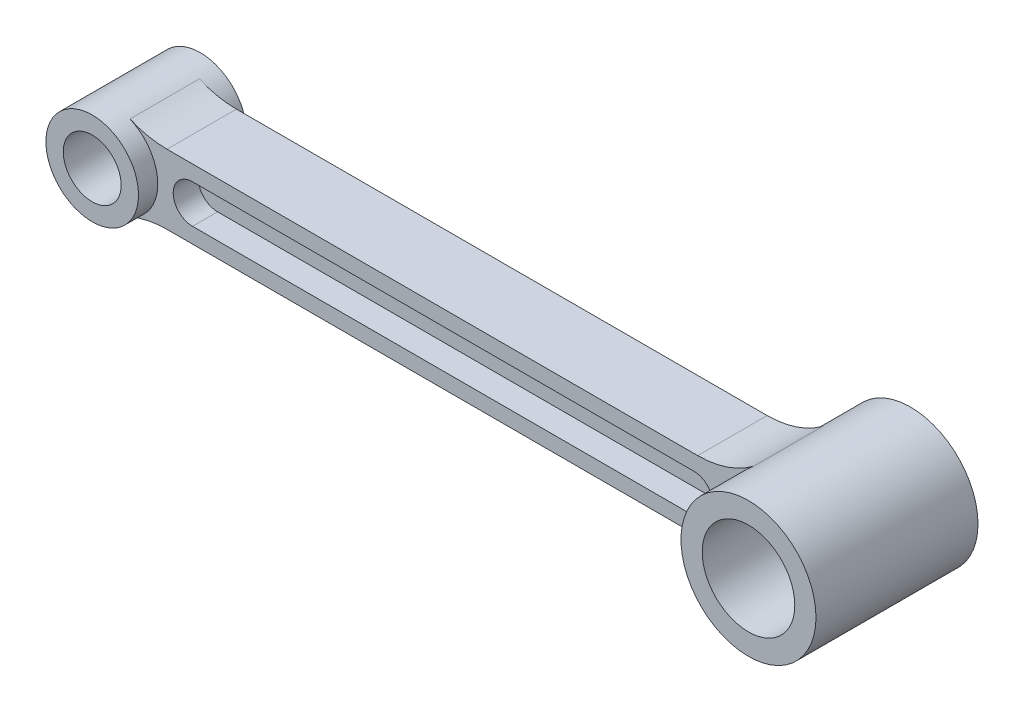
ISO-10303-21;
HEADER;
FILE_DESCRIPTION(('STEP AP214'),'2;1');
FILE_NAME('part.step','',(''),(''),'','','');
FILE_SCHEMA(('AUTOMOTIVE_DESIGN { 1 0 10303 214 1 1 1 1 }'));
ENDSEC;
DATA;
#1=APPLICATION_CONTEXT('core data for automotive mechanical design processes');
#2=APPLICATION_PROTOCOL_DEFINITION('international standard','automotive_design',2000,#1);
#3=PRODUCT_CONTEXT('',#1,'mechanical');
#4=PRODUCT('Part','Part','',(#3));
#5=PRODUCT_RELATED_PRODUCT_CATEGORY('part','',(#4));
#6=PRODUCT_DEFINITION_FORMATION('','',#4);
#7=PRODUCT_DEFINITION_CONTEXT('part definition',#1,'design');
#8=PRODUCT_DEFINITION('design','',#6,#7);
#9=PRODUCT_DEFINITION_SHAPE('','',#8);
#10=(LENGTH_UNIT() NAMED_UNIT(*) SI_UNIT(.MILLI.,.METRE.));
#11=(NAMED_UNIT(*) PLANE_ANGLE_UNIT() SI_UNIT($,.RADIAN.));
#12=(NAMED_UNIT(*) SI_UNIT($,.STERADIAN.) SOLID_ANGLE_UNIT());
#13=UNCERTAINTY_MEASURE_WITH_UNIT(LENGTH_MEASURE(1.E-05),#10,'distance_accuracy_value','');
#14=(GEOMETRIC_REPRESENTATION_CONTEXT(3) GLOBAL_UNCERTAINTY_ASSIGNED_CONTEXT((#13)) GLOBAL_UNIT_ASSIGNED_CONTEXT((#10,
#11,#12)) REPRESENTATION_CONTEXT('',''));
#15=CARTESIAN_POINT('',(0.,0.,0.));
#16=DIRECTION('',(0.,0.,1.));
#17=DIRECTION('',(1.,0.,0.));
#18=AXIS2_PLACEMENT_3D('',#15,#16,#17);
#19=CARTESIAN_POINT('',(0.,0.,9.));
#20=DIRECTION('',(0.,0.,1.));
#21=DIRECTION('',(1.,0.,0.));
#22=AXIS2_PLACEMENT_3D('',#19,#20,#21);
#23=PLANE('',#22);
#24=CARTESIAN_POINT('',(0.,0.,9.));
#25=DIRECTION('',(0.,0.,1.));
#26=DIRECTION('',(1.,0.,0.));
#27=AXIS2_PLACEMENT_3D('',#24,#25,#26);
#28=CIRCLE('',#27,12.);
#29=CARTESIAN_POINT('',(4.79583152331272,-11.,9.));
#30=VERTEX_POINT('',#29);
#31=CARTESIAN_POINT('',(4.79583152331272,11.,9.));
#32=VERTEX_POINT('',#31);
#33=EDGE_CURVE('E234',#30,#32,#28,.T.);
#34=ORIENTED_EDGE('',*,*,#33,.F.);
#35=CARTESIAN_POINT('',(14.3874945699382,-33.,9.));
#36=DIRECTION('',(0.,0.,1.));
#37=DIRECTION('',(1.,0.,0.));
#38=AXIS2_PLACEMENT_3D('',#35,#36,#37);
#39=CIRCLE('',#38,24.);
#40=CARTESIAN_POINT('',(14.3874945699382,-9.,9.));
#41=VERTEX_POINT('',#40);
#42=EDGE_CURVE('E288',#30,#41,#39,.F.);
#43=ORIENTED_EDGE('',*,*,#42,.T.);
#44=DIRECTION('',(1.,0.,0.));
#45=VECTOR('',#44,1.);
#46=CARTESIAN_POINT('',(0.,-9.,9.));
#47=LINE('',#46,#45);
#48=CARTESIAN_POINT('',(151.972753031747,-9.,9.));
#49=VERTEX_POINT('',#48);
#50=EDGE_CURVE('E236',#41,#49,#47,.T.);
#51=ORIENTED_EDGE('',*,*,#50,.T.);
#52=CARTESIAN_POINT('',(151.972753031747,-33.,9.));
#53=DIRECTION('',(0.,0.,1.));
#54=DIRECTION('',(1.,0.,0.));
#55=AXIS2_PLACEMENT_3D('',#52,#53,#54);
#56=CIRCLE('',#55,24.);
#57=CARTESIAN_POINT('',(166.525693213524,-13.9156626506024,9.));
#58=VERTEX_POINT('',#57);
#59=EDGE_CURVE('E292',#49,#58,#56,.F.);
#60=ORIENTED_EDGE('',*,*,#59,.T.);
#61=CARTESIAN_POINT('',(177.13721209607,0.,9.));
#62=DIRECTION('',(0.,0.,1.));
#63=DIRECTION('',(1.,0.,0.));
#64=AXIS2_PLACEMENT_3D('',#61,#62,#63);
#65=CIRCLE('',#64,17.5);
#66=CARTESIAN_POINT('',(166.525693213524,13.9156626506024,9.));
#67=VERTEX_POINT('',#66);
#68=EDGE_CURVE('E240',#67,#58,#65,.T.);
#69=ORIENTED_EDGE('',*,*,#68,.F.);
#70=CARTESIAN_POINT('',(151.972753031747,33.,9.));
#71=DIRECTION('',(0.,0.,1.));
#72=DIRECTION('',(1.,0.,0.));
#73=AXIS2_PLACEMENT_3D('',#70,#71,#72);
#74=CIRCLE('',#73,24.);
#75=CARTESIAN_POINT('',(151.972753031747,9.,9.));
#76=VERTEX_POINT('',#75);
#77=EDGE_CURVE('E50',#67,#76,#74,.F.);
#78=ORIENTED_EDGE('',*,*,#77,.T.);
#79=DIRECTION('',(1.,0.,0.));
#80=VECTOR('',#79,1.);
#81=CARTESIAN_POINT('',(0.,9.,9.));
#82=LINE('',#81,#80);
#83=CARTESIAN_POINT('',(14.3874945699382,9.,9.));
#84=VERTEX_POINT('',#83);
#85=EDGE_CURVE('E242',#84,#76,#82,.T.);
#86=ORIENTED_EDGE('',*,*,#85,.F.);
#87=CARTESIAN_POINT('',(14.3874945699382,33.,9.));
#88=DIRECTION('',(0.,0.,1.));
#89=DIRECTION('',(1.,0.,0.));
#90=AXIS2_PLACEMENT_3D('',#87,#88,#89);
#91=CIRCLE('',#90,24.);
#92=EDGE_CURVE('E11',#84,#32,#91,.F.);
#93=ORIENTED_EDGE('',*,*,#92,.T.);
#94=EDGE_LOOP('',(#34,#43,#51,#60,#69,#78,#86,#93));
#95=FACE_BOUND('',#94,.T.);
#96=DIRECTION('',(1.,0.,0.));
#97=VECTOR('',#96,1.);
#98=CARTESIAN_POINT('',(21.,-5.,9.));
#99=LINE('',#98,#97);
#100=CARTESIAN_POINT('',(21.,-5.,9.));
#101=VERTEX_POINT('',#100);
#102=CARTESIAN_POINT('',(151.,-5.,9.));
#103=VERTEX_POINT('',#102);
#104=EDGE_CURVE('E194',#101,#103,#99,.T.);
#105=ORIENTED_EDGE('',*,*,#104,.F.);
#106=CARTESIAN_POINT('',(21.,0.,9.));
#107=DIRECTION('',(0.,0.,1.));
#108=DIRECTION('',(1.,0.,0.));
#109=AXIS2_PLACEMENT_3D('',#106,#107,#108);
#110=CIRCLE('',#109,5.);
#111=CARTESIAN_POINT('',(21.,5.,9.));
#112=VERTEX_POINT('',#111);
#113=EDGE_CURVE('E192',#112,#101,#110,.T.);
#114=ORIENTED_EDGE('',*,*,#113,.F.);
#115=DIRECTION('',(-1.,0.,0.));
#116=VECTOR('',#115,1.);
#117=CARTESIAN_POINT('',(21.,5.,9.));
#118=LINE('',#117,#116);
#119=CARTESIAN_POINT('',(151.,5.,9.));
#120=VERTEX_POINT('',#119);
#121=EDGE_CURVE('E200',#120,#112,#118,.T.);
#122=ORIENTED_EDGE('',*,*,#121,.F.);
#123=CARTESIAN_POINT('',(151.,0.,9.));
#124=DIRECTION('',(0.,0.,1.));
#125=DIRECTION('',(1.,0.,0.));
#126=AXIS2_PLACEMENT_3D('',#123,#124,#125);
#127=CIRCLE('',#126,5.);
#128=EDGE_CURVE('E197',#103,#120,#127,.T.);
#129=ORIENTED_EDGE('',*,*,#128,.F.);
#130=EDGE_LOOP('',(#105,#114,#122,#129));
#131=FACE_BOUND('',#130,.T.);
#132=ADVANCED_FACE('F35',(#95,#131),#23,.T.);
#133=CARTESIAN_POINT('',(0.,0.,14.));
#134=DIRECTION('',(0.,0.,-1.));
#135=DIRECTION('',(-1.,0.,0.));
#136=AXIS2_PLACEMENT_3D('',#133,#134,#135);
#137=CYLINDRICAL_SURFACE('',#136,12.);
#138=CARTESIAN_POINT('',(0.,0.,-9.));
#139=DIRECTION('',(0.,0.,1.));
#140=DIRECTION('',(1.,0.,0.));
#141=AXIS2_PLACEMENT_3D('',#138,#139,#140);
#142=CIRCLE('',#141,12.);
#143=CARTESIAN_POINT('',(4.79583152331272,-11.,-9.));
#144=VERTEX_POINT('',#143);
#145=CARTESIAN_POINT('',(4.79583152331272,11.,-9.));
#146=VERTEX_POINT('',#145);
#147=EDGE_CURVE('E229',#144,#146,#142,.T.);
#148=ORIENTED_EDGE('',*,*,#147,.F.);
#149=DIRECTION('',(0.,0.,-1.));
#150=VECTOR('',#149,1.);
#151=CARTESIAN_POINT('',(4.79583152331272,-11.,14.));
#152=LINE('',#151,#150);
#153=EDGE_CURVE('E272',#144,#30,#152,.F.);
#154=ORIENTED_EDGE('',*,*,#153,.T.);
#155=ORIENTED_EDGE('',*,*,#33,.T.);
#156=DIRECTION('',(0.,0.,-1.));
#157=VECTOR('',#156,1.);
#158=CARTESIAN_POINT('',(4.79583152331272,11.,14.));
#159=LINE('',#158,#157);
#160=EDGE_CURVE('E269',#32,#146,#159,.T.);
#161=ORIENTED_EDGE('',*,*,#160,.T.);
#162=EDGE_LOOP('',(#148,#154,#155,#161));
#163=FACE_BOUND('',#162,.T.);
#164=CARTESIAN_POINT('',(0.,0.,14.));
#165=DIRECTION('',(0.,0.,1.));
#166=DIRECTION('',(1.,0.,0.));
#167=AXIS2_PLACEMENT_3D('',#164,#165,#166);
#168=CIRCLE('',#167,12.);
#169=CARTESIAN_POINT('',(12.,0.,14.));
#170=VERTEX_POINT('',#169);
#171=EDGE_CURVE('E253',#170,#170,#168,.T.);
#172=ORIENTED_EDGE('',*,*,#171,.F.);
#173=EDGE_LOOP('',(#172));
#174=FACE_BOUND('',#173,.T.);
#175=CARTESIAN_POINT('',(0.,0.,-14.));
#176=DIRECTION('',(0.,0.,1.));
#177=DIRECTION('',(1.,0.,0.));
#178=AXIS2_PLACEMENT_3D('',#175,#176,#177);
#179=CIRCLE('',#178,12.);
#180=CARTESIAN_POINT('',(12.,0.,-14.));
#181=VERTEX_POINT('',#180);
#182=EDGE_CURVE('E244',#181,#181,#179,.T.);
#183=ORIENTED_EDGE('',*,*,#182,.T.);
#184=EDGE_LOOP('',(#183));
#185=FACE_BOUND('',#184,.T.);
#186=ADVANCED_FACE('F327',(#163,#174,#185),#137,.T.);
#187=CARTESIAN_POINT('',(0.,0.,14.));
#188=DIRECTION('',(0.,0.,-1.));
#189=DIRECTION('',(-1.,0.,0.));
#190=AXIS2_PLACEMENT_3D('',#187,#188,#189);
#191=CYLINDRICAL_SURFACE('',#190,7.5);
#192=CARTESIAN_POINT('',(0.,0.,14.));
#193=DIRECTION('',(0.,0.,1.));
#194=DIRECTION('',(1.,0.,0.));
#195=AXIS2_PLACEMENT_3D('',#192,#193,#194);
#196=CIRCLE('',#195,7.5);
#197=CARTESIAN_POINT('',(7.5,0.,14.));
#198=VERTEX_POINT('',#197);
#199=EDGE_CURVE('E256',#198,#198,#196,.T.);
#200=ORIENTED_EDGE('',*,*,#199,.T.);
#201=EDGE_LOOP('',(#200));
#202=FACE_BOUND('',#201,.T.);
#203=CARTESIAN_POINT('',(0.,0.,-14.));
#204=DIRECTION('',(0.,0.,1.));
#205=DIRECTION('',(1.,0.,0.));
#206=AXIS2_PLACEMENT_3D('',#203,#204,#205);
#207=CIRCLE('',#206,7.5);
#208=CARTESIAN_POINT('',(7.5,0.,-14.));
#209=VERTEX_POINT('',#208);
#210=EDGE_CURVE('E257',#209,#209,#207,.T.);
#211=ORIENTED_EDGE('',*,*,#210,.F.);
#212=EDGE_LOOP('',(#211));
#213=FACE_BOUND('',#212,.T.);
#214=ADVANCED_FACE('F330',(#202,#213),#191,.F.);
#215=CARTESIAN_POINT('',(0.,0.,14.));
#216=DIRECTION('',(0.,0.,1.));
#217=DIRECTION('',(1.,0.,0.));
#218=AXIS2_PLACEMENT_3D('',#215,#216,#217);
#219=PLANE('',#218);
#220=ORIENTED_EDGE('',*,*,#171,.T.);
#221=EDGE_LOOP('',(#220));
#222=FACE_BOUND('',#221,.T.);
#223=ORIENTED_EDGE('',*,*,#199,.F.);
#224=EDGE_LOOP('',(#223));
#225=FACE_BOUND('',#224,.T.);
#226=ADVANCED_FACE('F339',(#222,#225),#219,.T.);
#227=CARTESIAN_POINT('',(0.,0.,-14.));
#228=DIRECTION('',(0.,0.,1.));
#229=DIRECTION('',(1.,0.,0.));
#230=AXIS2_PLACEMENT_3D('',#227,#228,#229);
#231=PLANE('',#230);
#232=ORIENTED_EDGE('',*,*,#182,.F.);
#233=EDGE_LOOP('',(#232));
#234=FACE_BOUND('',#233,.T.);
#235=ORIENTED_EDGE('',*,*,#210,.T.);
#236=EDGE_LOOP('',(#235));
#237=FACE_BOUND('',#236,.T.);
#238=ADVANCED_FACE('F336',(#234,#237),#231,.F.);
#239=CARTESIAN_POINT('',(0.,-9.,9.));
#240=DIRECTION('',(0.,1.,0.));
#241=DIRECTION('',(0.,0.,1.));
#242=AXIS2_PLACEMENT_3D('',#239,#240,#241);
#243=PLANE('',#242);
#244=ORIENTED_EDGE('',*,*,#50,.F.);
#245=DIRECTION('',(0.,0.,1.));
#246=VECTOR('',#245,1.);
#247=CARTESIAN_POINT('',(14.3874945699382,-9.,-9.));
#248=LINE('',#247,#246);
#249=CARTESIAN_POINT('',(14.3874945699382,-9.,-9.));
#250=VERTEX_POINT('',#249);
#251=EDGE_CURVE('E266',#41,#250,#248,.F.);
#252=ORIENTED_EDGE('',*,*,#251,.T.);
#253=DIRECTION('',(1.,0.,0.));
#254=VECTOR('',#253,1.);
#255=CARTESIAN_POINT('',(0.,-9.,-9.));
#256=LINE('',#255,#254);
#257=CARTESIAN_POINT('',(151.972753031747,-9.,-9.));
#258=VERTEX_POINT('',#257);
#259=EDGE_CURVE('E246',#250,#258,#256,.T.);
#260=ORIENTED_EDGE('',*,*,#259,.T.);
#261=DIRECTION('',(0.,0.,1.));
#262=VECTOR('',#261,1.);
#263=CARTESIAN_POINT('',(151.972753031747,-9.,9.));
#264=LINE('',#263,#262);
#265=EDGE_CURVE('E260',#258,#49,#264,.T.);
#266=ORIENTED_EDGE('',*,*,#265,.T.);
#267=EDGE_LOOP('',(#244,#252,#260,#266));
#268=FACE_BOUND('',#267,.T.);
#269=ADVANCED_FACE('F322',(#268),#243,.F.);
#270=CARTESIAN_POINT('',(0.,9.,9.));
#271=DIRECTION('',(0.,1.,0.));
#272=DIRECTION('',(0.,0.,1.));
#273=AXIS2_PLACEMENT_3D('',#270,#271,#272);
#274=PLANE('',#273);
#275=ORIENTED_EDGE('',*,*,#85,.T.);
#276=DIRECTION('',(0.,0.,-1.));
#277=VECTOR('',#276,1.);
#278=CARTESIAN_POINT('',(151.972753031747,9.,9.));
#279=LINE('',#278,#277);
#280=CARTESIAN_POINT('',(151.972753031747,9.,-9.));
#281=VERTEX_POINT('',#280);
#282=EDGE_CURVE('E282',#76,#281,#279,.T.);
#283=ORIENTED_EDGE('',*,*,#282,.T.);
#284=DIRECTION('',(1.,0.,0.));
#285=VECTOR('',#284,1.);
#286=CARTESIAN_POINT('',(0.,9.,-9.));
#287=LINE('',#286,#285);
#288=CARTESIAN_POINT('',(14.3874945699382,9.,-9.));
#289=VERTEX_POINT('',#288);
#290=EDGE_CURVE('E237',#289,#281,#287,.T.);
#291=ORIENTED_EDGE('',*,*,#290,.F.);
#292=DIRECTION('',(0.,0.,-1.));
#293=VECTOR('',#292,1.);
#294=CARTESIAN_POINT('',(14.3874945699382,9.,9.));
#295=LINE('',#294,#293);
#296=EDGE_CURVE('E57',#289,#84,#295,.F.);
#297=ORIENTED_EDGE('',*,*,#296,.T.);
#298=EDGE_LOOP('',(#275,#283,#291,#297));
#299=FACE_BOUND('',#298,.T.);
#300=ADVANCED_FACE('F301',(#299),#274,.T.);
#301=CARTESIAN_POINT('',(0.,0.,-9.));
#302=DIRECTION('',(0.,0.,1.));
#303=DIRECTION('',(1.,0.,0.));
#304=AXIS2_PLACEMENT_3D('',#301,#302,#303);
#305=PLANE('',#304);
#306=DIRECTION('',(-1.,0.,0.));
#307=VECTOR('',#306,1.);
#308=CARTESIAN_POINT('',(21.,5.,-9.));
#309=LINE('',#308,#307);
#310=CARTESIAN_POINT('',(151.,5.,-9.));
#311=VERTEX_POINT('',#310);
#312=CARTESIAN_POINT('',(21.,5.,-9.));
#313=VERTEX_POINT('',#312);
#314=EDGE_CURVE('E153',#311,#313,#309,.T.);
#315=ORIENTED_EDGE('',*,*,#314,.T.);
#316=CARTESIAN_POINT('',(21.,0.,-9.));
#317=DIRECTION('',(0.,0.,1.));
#318=DIRECTION('',(1.,0.,0.));
#319=AXIS2_PLACEMENT_3D('',#316,#317,#318);
#320=CIRCLE('',#319,5.);
#321=CARTESIAN_POINT('',(21.,-5.,-9.));
#322=VERTEX_POINT('',#321);
#323=EDGE_CURVE('E164',#313,#322,#320,.T.);
#324=ORIENTED_EDGE('',*,*,#323,.T.);
#325=DIRECTION('',(1.,0.,0.));
#326=VECTOR('',#325,1.);
#327=CARTESIAN_POINT('',(21.,-5.,-9.));
#328=LINE('',#327,#326);
#329=CARTESIAN_POINT('',(151.,-5.,-9.));
#330=VERTEX_POINT('',#329);
#331=EDGE_CURVE('E176',#322,#330,#328,.T.);
#332=ORIENTED_EDGE('',*,*,#331,.T.);
#333=CARTESIAN_POINT('',(151.,0.,-9.));
#334=DIRECTION('',(0.,0.,1.));
#335=DIRECTION('',(1.,0.,0.));
#336=AXIS2_PLACEMENT_3D('',#333,#334,#335);
#337=CIRCLE('',#336,5.);
#338=EDGE_CURVE('E174',#330,#311,#337,.T.);
#339=ORIENTED_EDGE('',*,*,#338,.T.);
#340=EDGE_LOOP('',(#315,#324,#332,#339));
#341=FACE_BOUND('',#340,.T.);
#342=ORIENTED_EDGE('',*,*,#147,.T.);
#343=CARTESIAN_POINT('',(14.3874945699382,33.,-9.));
#344=DIRECTION('',(0.,0.,1.));
#345=DIRECTION('',(1.,0.,0.));
#346=AXIS2_PLACEMENT_3D('',#343,#344,#345);
#347=CIRCLE('',#346,24.);
#348=EDGE_CURVE('E43',#146,#289,#347,.T.);
#349=ORIENTED_EDGE('',*,*,#348,.T.);
#350=ORIENTED_EDGE('',*,*,#290,.T.);
#351=CARTESIAN_POINT('',(151.972753031747,33.,-9.));
#352=DIRECTION('',(0.,0.,1.));
#353=DIRECTION('',(1.,0.,0.));
#354=AXIS2_PLACEMENT_3D('',#351,#352,#353);
#355=CIRCLE('',#354,24.);
#356=CARTESIAN_POINT('',(166.525693213524,13.9156626506024,-9.));
#357=VERTEX_POINT('',#356);
#358=EDGE_CURVE('E295',#281,#357,#355,.T.);
#359=ORIENTED_EDGE('',*,*,#358,.T.);
#360=CARTESIAN_POINT('',(177.13721209607,0.,-9.));
#361=DIRECTION('',(0.,0.,1.));
#362=DIRECTION('',(1.,0.,0.));
#363=AXIS2_PLACEMENT_3D('',#360,#361,#362);
#364=CIRCLE('',#363,17.5);
#365=CARTESIAN_POINT('',(166.525693213524,-13.9156626506024,-9.));
#366=VERTEX_POINT('',#365);
#367=EDGE_CURVE('E249',#357,#366,#364,.T.);
#368=ORIENTED_EDGE('',*,*,#367,.T.);
#369=CARTESIAN_POINT('',(151.972753031747,-33.,-9.));
#370=DIRECTION('',(0.,0.,1.));
#371=DIRECTION('',(1.,0.,0.));
#372=AXIS2_PLACEMENT_3D('',#369,#370,#371);
#373=CIRCLE('',#372,24.);
#374=EDGE_CURVE('E290',#366,#258,#373,.T.);
#375=ORIENTED_EDGE('',*,*,#374,.T.);
#376=ORIENTED_EDGE('',*,*,#259,.F.);
#377=CARTESIAN_POINT('',(14.3874945699382,-33.,-9.));
#378=DIRECTION('',(0.,0.,1.));
#379=DIRECTION('',(1.,0.,0.));
#380=AXIS2_PLACEMENT_3D('',#377,#378,#379);
#381=CIRCLE('',#380,24.);
#382=EDGE_CURVE('E285',#250,#144,#381,.T.);
#383=ORIENTED_EDGE('',*,*,#382,.T.);
#384=EDGE_LOOP('',(#342,#349,#350,#359,#368,#375,#376,#383));
#385=FACE_BOUND('',#384,.T.);
#386=ADVANCED_FACE('F172',(#341,#385),#305,.F.);
#387=CARTESIAN_POINT('',(177.13721209607,0.,21.));
#388=DIRECTION('',(0.,0.,-1.));
#389=DIRECTION('',(-1.,0.,0.));
#390=AXIS2_PLACEMENT_3D('',#387,#388,#389);
#391=CYLINDRICAL_SURFACE('',#390,12.);
#392=CARTESIAN_POINT('',(177.13721209607,0.,21.));
#393=DIRECTION('',(0.,0.,1.));
#394=DIRECTION('',(1.,0.,0.));
#395=AXIS2_PLACEMENT_3D('',#392,#393,#394);
#396=CIRCLE('',#395,12.);
#397=CARTESIAN_POINT('',(189.13721209607,0.,21.));
#398=VERTEX_POINT('',#397);
#399=EDGE_CURVE('E222',#398,#398,#396,.T.);
#400=ORIENTED_EDGE('',*,*,#399,.T.);
#401=EDGE_LOOP('',(#400));
#402=FACE_BOUND('',#401,.T.);
#403=CARTESIAN_POINT('',(177.13721209607,0.,-21.));
#404=DIRECTION('',(0.,0.,1.));
#405=DIRECTION('',(1.,0.,0.));
#406=AXIS2_PLACEMENT_3D('',#403,#404,#405);
#407=CIRCLE('',#406,12.);
#408=CARTESIAN_POINT('',(189.13721209607,0.,-21.));
#409=VERTEX_POINT('',#408);
#410=EDGE_CURVE('E221',#409,#409,#407,.T.);
#411=ORIENTED_EDGE('',*,*,#410,.F.);
#412=EDGE_LOOP('',(#411));
#413=FACE_BOUND('',#412,.T.);
#414=ADVANCED_FACE('F357',(#402,#413),#391,.F.);
#415=CARTESIAN_POINT('',(177.13721209607,0.,21.));
#416=DIRECTION('',(0.,0.,-1.));
#417=DIRECTION('',(-1.,0.,0.));
#418=AXIS2_PLACEMENT_3D('',#415,#416,#417);
#419=CYLINDRICAL_SURFACE('',#418,17.5);
#420=DIRECTION('',(0.,0.,-1.));
#421=VECTOR('',#420,1.);
#422=CARTESIAN_POINT('',(166.525693213524,-13.9156626506024,21.));
#423=LINE('',#422,#421);
#424=EDGE_CURVE('E278',#58,#366,#423,.T.);
#425=ORIENTED_EDGE('',*,*,#424,.T.);
#426=ORIENTED_EDGE('',*,*,#367,.F.);
#427=DIRECTION('',(0.,0.,-1.));
#428=VECTOR('',#427,1.);
#429=CARTESIAN_POINT('',(166.525693213524,13.9156626506024,21.));
#430=LINE('',#429,#428);
#431=EDGE_CURVE('E275',#357,#67,#430,.F.);
#432=ORIENTED_EDGE('',*,*,#431,.T.);
#433=ORIENTED_EDGE('',*,*,#68,.T.);
#434=EDGE_LOOP('',(#425,#426,#432,#433));
#435=FACE_BOUND('',#434,.T.);
#436=CARTESIAN_POINT('',(177.13721209607,0.,21.));
#437=DIRECTION('',(0.,0.,1.));
#438=DIRECTION('',(1.,0.,0.));
#439=AXIS2_PLACEMENT_3D('',#436,#437,#438);
#440=CIRCLE('',#439,17.5);
#441=CARTESIAN_POINT('',(194.63721209607,0.,21.));
#442=VERTEX_POINT('',#441);
#443=EDGE_CURVE('E225',#442,#442,#440,.T.);
#444=ORIENTED_EDGE('',*,*,#443,.F.);
#445=EDGE_LOOP('',(#444));
#446=FACE_BOUND('',#445,.T.);
#447=CARTESIAN_POINT('',(177.13721209607,0.,-21.));
#448=DIRECTION('',(0.,0.,1.));
#449=DIRECTION('',(1.,0.,0.));
#450=AXIS2_PLACEMENT_3D('',#447,#448,#449);
#451=CIRCLE('',#450,17.5);
#452=CARTESIAN_POINT('',(194.63721209607,0.,-21.));
#453=VERTEX_POINT('',#452);
#454=EDGE_CURVE('E226',#453,#453,#451,.T.);
#455=ORIENTED_EDGE('',*,*,#454,.T.);
#456=EDGE_LOOP('',(#455));
#457=FACE_BOUND('',#456,.T.);
#458=ADVANCED_FACE('F316',(#435,#446,#457),#419,.T.);
#459=CARTESIAN_POINT('',(0.,0.,21.));
#460=DIRECTION('',(0.,0.,1.));
#461=DIRECTION('',(1.,0.,0.));
#462=AXIS2_PLACEMENT_3D('',#459,#460,#461);
#463=PLANE('',#462);
#464=ORIENTED_EDGE('',*,*,#399,.F.);
#465=EDGE_LOOP('',(#464));
#466=FACE_BOUND('',#465,.T.);
#467=ORIENTED_EDGE('',*,*,#443,.T.);
#468=EDGE_LOOP('',(#467));
#469=FACE_BOUND('',#468,.T.);
#470=ADVANCED_FACE('F390',(#466,#469),#463,.T.);
#471=CARTESIAN_POINT('',(0.,0.,-21.));
#472=DIRECTION('',(0.,0.,1.));
#473=DIRECTION('',(1.,0.,0.));
#474=AXIS2_PLACEMENT_3D('',#471,#472,#473);
#475=PLANE('',#474);
#476=ORIENTED_EDGE('',*,*,#410,.T.);
#477=EDGE_LOOP('',(#476));
#478=FACE_BOUND('',#477,.T.);
#479=ORIENTED_EDGE('',*,*,#454,.F.);
#480=EDGE_LOOP('',(#479));
#481=FACE_BOUND('',#480,.T.);
#482=ADVANCED_FACE('F396',(#478,#481),#475,.F.);
#483=CARTESIAN_POINT('',(21.,0.,9.));
#484=DIRECTION('',(0.,0.,-1.));
#485=DIRECTION('',(-1.,0.,0.));
#486=AXIS2_PLACEMENT_3D('',#483,#484,#485);
#487=CYLINDRICAL_SURFACE('',#486,5.);
#488=CARTESIAN_POINT('',(21.,0.,2.5));
#489=DIRECTION('',(0.,0.,1.));
#490=DIRECTION('',(1.,0.,0.));
#491=AXIS2_PLACEMENT_3D('',#488,#489,#490);
#492=CIRCLE('',#491,5.);
#493=CARTESIAN_POINT('',(21.,5.,2.5));
#494=VERTEX_POINT('',#493);
#495=CARTESIAN_POINT('',(21.,-5.,2.5));
#496=VERTEX_POINT('',#495);
#497=EDGE_CURVE('E160',#494,#496,#492,.T.);
#498=ORIENTED_EDGE('',*,*,#497,.F.);
#499=DIRECTION('',(0.,0.,-1.));
#500=VECTOR('',#499,1.);
#501=CARTESIAN_POINT('',(21.,5.,9.));
#502=LINE('',#501,#500);
#503=EDGE_CURVE('E202',#112,#494,#502,.T.);
#504=ORIENTED_EDGE('',*,*,#503,.F.);
#505=ORIENTED_EDGE('',*,*,#113,.T.);
#506=DIRECTION('',(0.,0.,-1.));
#507=VECTOR('',#506,1.);
#508=CARTESIAN_POINT('',(21.,-5.,9.));
#509=LINE('',#508,#507);
#510=EDGE_CURVE('E218',#101,#496,#509,.T.);
#511=ORIENTED_EDGE('',*,*,#510,.T.);
#512=EDGE_LOOP('',(#498,#504,#505,#511));
#513=FACE_BOUND('',#512,.T.);
#514=ADVANCED_FACE('F404',(#513),#487,.F.);
#515=CARTESIAN_POINT('',(21.,-5.,9.));
#516=DIRECTION('',(0.,1.,0.));
#517=DIRECTION('',(0.,0.,1.));
#518=AXIS2_PLACEMENT_3D('',#515,#516,#517);
#519=PLANE('',#518);
#520=DIRECTION('',(1.,0.,0.));
#521=VECTOR('',#520,1.);
#522=CARTESIAN_POINT('',(21.,-5.,2.5));
#523=LINE('',#522,#521);
#524=CARTESIAN_POINT('',(151.,-5.,2.5));
#525=VERTEX_POINT('',#524);
#526=EDGE_CURVE('E205',#496,#525,#523,.T.);
#527=ORIENTED_EDGE('',*,*,#526,.F.);
#528=ORIENTED_EDGE('',*,*,#510,.F.);
#529=ORIENTED_EDGE('',*,*,#104,.T.);
#530=DIRECTION('',(0.,0.,-1.));
#531=VECTOR('',#530,1.);
#532=CARTESIAN_POINT('',(151.,-5.,9.));
#533=LINE('',#532,#531);
#534=EDGE_CURVE('E215',#103,#525,#533,.T.);
#535=ORIENTED_EDGE('',*,*,#534,.T.);
#536=EDGE_LOOP('',(#527,#528,#529,#535));
#537=FACE_BOUND('',#536,.T.);
#538=ADVANCED_FACE('F412',(#537),#519,.T.);
#539=CARTESIAN_POINT('',(151.,0.,9.));
#540=DIRECTION('',(0.,0.,-1.));
#541=DIRECTION('',(-1.,0.,0.));
#542=AXIS2_PLACEMENT_3D('',#539,#540,#541);
#543=CYLINDRICAL_SURFACE('',#542,5.);
#544=CARTESIAN_POINT('',(151.,0.,2.5));
#545=DIRECTION('',(0.,0.,1.));
#546=DIRECTION('',(1.,0.,0.));
#547=AXIS2_PLACEMENT_3D('',#544,#545,#546);
#548=CIRCLE('',#547,5.);
#549=CARTESIAN_POINT('',(151.,5.,2.5));
#550=VERTEX_POINT('',#549);
#551=EDGE_CURVE('E207',#525,#550,#548,.T.);
#552=ORIENTED_EDGE('',*,*,#551,.F.);
#553=ORIENTED_EDGE('',*,*,#534,.F.);
#554=ORIENTED_EDGE('',*,*,#128,.T.);
#555=DIRECTION('',(0.,0.,-1.));
#556=VECTOR('',#555,1.);
#557=CARTESIAN_POINT('',(151.,5.,9.));
#558=LINE('',#557,#556);
#559=EDGE_CURVE('E212',#120,#550,#558,.T.);
#560=ORIENTED_EDGE('',*,*,#559,.T.);
#561=EDGE_LOOP('',(#552,#553,#554,#560));
#562=FACE_BOUND('',#561,.T.);
#563=ADVANCED_FACE('F420',(#562),#543,.F.);
#564=CARTESIAN_POINT('',(21.,5.,9.));
#565=DIRECTION('',(0.,-1.,0.));
#566=DIRECTION('',(0.,0.,-1.));
#567=AXIS2_PLACEMENT_3D('',#564,#565,#566);
#568=PLANE('',#567);
#569=DIRECTION('',(-1.,0.,0.));
#570=VECTOR('',#569,1.);
#571=CARTESIAN_POINT('',(21.,5.,2.5));
#572=LINE('',#571,#570);
#573=EDGE_CURVE('E195',#550,#494,#572,.T.);
#574=ORIENTED_EDGE('',*,*,#573,.F.);
#575=ORIENTED_EDGE('',*,*,#559,.F.);
#576=ORIENTED_EDGE('',*,*,#121,.T.);
#577=ORIENTED_EDGE('',*,*,#503,.T.);
#578=EDGE_LOOP('',(#574,#575,#576,#577));
#579=FACE_BOUND('',#578,.T.);
#580=ADVANCED_FACE('F428',(#579),#568,.T.);
#581=CARTESIAN_POINT('',(21.,0.,2.5));
#582=DIRECTION('',(0.,0.,1.));
#583=DIRECTION('',(1.,0.,0.));
#584=AXIS2_PLACEMENT_3D('',#581,#582,#583);
#585=PLANE('',#584);
#586=ORIENTED_EDGE('',*,*,#497,.T.);
#587=ORIENTED_EDGE('',*,*,#526,.T.);
#588=ORIENTED_EDGE('',*,*,#551,.T.);
#589=ORIENTED_EDGE('',*,*,#573,.T.);
#590=EDGE_LOOP('',(#586,#587,#588,#589));
#591=FACE_BOUND('',#590,.T.);
#592=ADVANCED_FACE('F436',(#591),#585,.T.);
#593=CARTESIAN_POINT('',(21.,0.,-9.));
#594=DIRECTION('',(0.,0.,1.));
#595=DIRECTION('',(1.,0.,0.));
#596=AXIS2_PLACEMENT_3D('',#593,#594,#595);
#597=CYLINDRICAL_SURFACE('',#596,5.);
#598=CARTESIAN_POINT('',(21.,0.,-2.5));
#599=DIRECTION('',(0.,0.,1.));
#600=DIRECTION('',(1.,0.,0.));
#601=AXIS2_PLACEMENT_3D('',#598,#599,#600);
#602=CIRCLE('',#601,5.);
#603=CARTESIAN_POINT('',(21.,5.,-2.5));
#604=VERTEX_POINT('',#603);
#605=CARTESIAN_POINT('',(21.,-5.,-2.5));
#606=VERTEX_POINT('',#605);
#607=EDGE_CURVE('E180',#604,#606,#602,.T.);
#608=ORIENTED_EDGE('',*,*,#607,.T.);
#609=DIRECTION('',(0.,0.,1.));
#610=VECTOR('',#609,1.);
#611=CARTESIAN_POINT('',(21.,-5.,-9.));
#612=LINE('',#611,#610);
#613=EDGE_CURVE('E166',#322,#606,#612,.T.);
#614=ORIENTED_EDGE('',*,*,#613,.F.);
#615=ORIENTED_EDGE('',*,*,#323,.F.);
#616=DIRECTION('',(0.,0.,1.));
#617=VECTOR('',#616,1.);
#618=CARTESIAN_POINT('',(21.,5.,-9.));
#619=LINE('',#618,#617);
#620=EDGE_CURVE('E149',#313,#604,#619,.T.);
#621=ORIENTED_EDGE('',*,*,#620,.T.);
#622=EDGE_LOOP('',(#608,#614,#615,#621));
#623=FACE_BOUND('',#622,.T.);
#624=ADVANCED_FACE('F165',(#623),#597,.F.);
#625=CARTESIAN_POINT('',(21.,5.,-9.));
#626=DIRECTION('',(0.,1.,0.));
#627=DIRECTION('',(0.,0.,1.));
#628=AXIS2_PLACEMENT_3D('',#625,#626,#627);
#629=PLANE('',#628);
#630=DIRECTION('',(-1.,0.,0.));
#631=VECTOR('',#630,1.);
#632=CARTESIAN_POINT('',(21.,5.,-2.5));
#633=LINE('',#632,#631);
#634=CARTESIAN_POINT('',(151.,5.,-2.5));
#635=VERTEX_POINT('',#634);
#636=EDGE_CURVE('E156',#635,#604,#633,.T.);
#637=ORIENTED_EDGE('',*,*,#636,.T.);
#638=ORIENTED_EDGE('',*,*,#620,.F.);
#639=ORIENTED_EDGE('',*,*,#314,.F.);
#640=DIRECTION('',(0.,0.,1.));
#641=VECTOR('',#640,1.);
#642=CARTESIAN_POINT('',(151.,5.,-9.));
#643=LINE('',#642,#641);
#644=EDGE_CURVE('E161',#311,#635,#643,.T.);
#645=ORIENTED_EDGE('',*,*,#644,.T.);
#646=EDGE_LOOP('',(#637,#638,#639,#645));
#647=FACE_BOUND('',#646,.T.);
#648=ADVANCED_FACE('F151',(#647),#629,.F.);
#649=CARTESIAN_POINT('',(151.,0.,-9.));
#650=DIRECTION('',(0.,0.,1.));
#651=DIRECTION('',(1.,0.,0.));
#652=AXIS2_PLACEMENT_3D('',#649,#650,#651);
#653=CYLINDRICAL_SURFACE('',#652,5.);
#654=CARTESIAN_POINT('',(151.,0.,-2.5));
#655=DIRECTION('',(0.,0.,1.));
#656=DIRECTION('',(1.,0.,0.));
#657=AXIS2_PLACEMENT_3D('',#654,#655,#656);
#658=CIRCLE('',#657,5.);
#659=CARTESIAN_POINT('',(151.,-5.,-2.5));
#660=VERTEX_POINT('',#659);
#661=EDGE_CURVE('E183',#660,#635,#658,.T.);
#662=ORIENTED_EDGE('',*,*,#661,.T.);
#663=ORIENTED_EDGE('',*,*,#644,.F.);
#664=ORIENTED_EDGE('',*,*,#338,.F.);
#665=DIRECTION('',(0.,0.,1.));
#666=VECTOR('',#665,1.);
#667=CARTESIAN_POINT('',(151.,-5.,-9.));
#668=LINE('',#667,#666);
#669=EDGE_CURVE('E189',#330,#660,#668,.T.);
#670=ORIENTED_EDGE('',*,*,#669,.T.);
#671=EDGE_LOOP('',(#662,#663,#664,#670));
#672=FACE_BOUND('',#671,.T.);
#673=ADVANCED_FACE('F457',(#672),#653,.F.);
#674=CARTESIAN_POINT('',(21.,-5.,-9.));
#675=DIRECTION('',(0.,-1.,0.));
#676=DIRECTION('',(0.,0.,-1.));
#677=AXIS2_PLACEMENT_3D('',#674,#675,#676);
#678=PLANE('',#677);
#679=DIRECTION('',(1.,0.,0.));
#680=VECTOR('',#679,1.);
#681=CARTESIAN_POINT('',(21.,-5.,-2.5));
#682=LINE('',#681,#680);
#683=EDGE_CURVE('E170',#606,#660,#682,.T.);
#684=ORIENTED_EDGE('',*,*,#683,.T.);
#685=ORIENTED_EDGE('',*,*,#669,.F.);
#686=ORIENTED_EDGE('',*,*,#331,.F.);
#687=ORIENTED_EDGE('',*,*,#613,.T.);
#688=EDGE_LOOP('',(#684,#685,#686,#687));
#689=FACE_BOUND('',#688,.T.);
#690=ADVANCED_FACE('F464',(#689),#678,.F.);
#691=CARTESIAN_POINT('',(21.,0.,-2.5));
#692=DIRECTION('',(0.,0.,-1.));
#693=DIRECTION('',(1.,0.,0.));
#694=AXIS2_PLACEMENT_3D('',#691,#692,#693);
#695=PLANE('',#694);
#696=ORIENTED_EDGE('',*,*,#607,.F.);
#697=ORIENTED_EDGE('',*,*,#636,.F.);
#698=ORIENTED_EDGE('',*,*,#661,.F.);
#699=ORIENTED_EDGE('',*,*,#683,.F.);
#700=EDGE_LOOP('',(#696,#697,#698,#699));
#701=FACE_BOUND('',#700,.T.);
#702=ADVANCED_FACE('F472',(#701),#695,.T.);
#703=CARTESIAN_POINT('',(14.3874945699382,-33.,14.));
#704=DIRECTION('',(0.,0.,-1.));
#705=DIRECTION('',(-1.,0.,0.));
#706=AXIS2_PLACEMENT_3D('',#703,#704,#705);
#707=CYLINDRICAL_SURFACE('',#706,24.);
#708=ORIENTED_EDGE('',*,*,#42,.F.);
#709=ORIENTED_EDGE('',*,*,#153,.F.);
#710=ORIENTED_EDGE('',*,*,#382,.F.);
#711=ORIENTED_EDGE('',*,*,#251,.F.);
#712=EDGE_LOOP('',(#708,#709,#710,#711));
#713=FACE_BOUND('',#712,.T.);
#714=ADVANCED_FACE('F324',(#713),#707,.F.);
#715=CARTESIAN_POINT('',(151.972753031747,-33.,21.));
#716=DIRECTION('',(0.,0.,-1.));
#717=DIRECTION('',(-1.,0.,0.));
#718=AXIS2_PLACEMENT_3D('',#715,#716,#717);
#719=CYLINDRICAL_SURFACE('',#718,24.);
#720=ORIENTED_EDGE('',*,*,#59,.F.);
#721=ORIENTED_EDGE('',*,*,#265,.F.);
#722=ORIENTED_EDGE('',*,*,#374,.F.);
#723=ORIENTED_EDGE('',*,*,#424,.F.);
#724=EDGE_LOOP('',(#720,#721,#722,#723));
#725=FACE_BOUND('',#724,.T.);
#726=ADVANCED_FACE('F315',(#725),#719,.F.);
#727=CARTESIAN_POINT('',(151.972753031747,33.,21.));
#728=DIRECTION('',(0.,0.,-1.));
#729=DIRECTION('',(-1.,0.,0.));
#730=AXIS2_PLACEMENT_3D('',#727,#728,#729);
#731=CYLINDRICAL_SURFACE('',#730,24.);
#732=ORIENTED_EDGE('',*,*,#77,.F.);
#733=ORIENTED_EDGE('',*,*,#431,.F.);
#734=ORIENTED_EDGE('',*,*,#358,.F.);
#735=ORIENTED_EDGE('',*,*,#282,.F.);
#736=EDGE_LOOP('',(#732,#733,#734,#735));
#737=FACE_BOUND('',#736,.T.);
#738=ADVANCED_FACE('F306',(#737),#731,.F.);
#739=CARTESIAN_POINT('',(14.3874945699382,33.,14.));
#740=DIRECTION('',(0.,0.,-1.));
#741=DIRECTION('',(-1.,0.,0.));
#742=AXIS2_PLACEMENT_3D('',#739,#740,#741);
#743=CYLINDRICAL_SURFACE('',#742,24.);
#744=ORIENTED_EDGE('',*,*,#92,.F.);
#745=ORIENTED_EDGE('',*,*,#296,.F.);
#746=ORIENTED_EDGE('',*,*,#348,.F.);
#747=ORIENTED_EDGE('',*,*,#160,.F.);
#748=EDGE_LOOP('',(#744,#745,#746,#747));
#749=FACE_BOUND('',#748,.T.);
#750=ADVANCED_FACE('F37',(#749),#743,.F.);
#751=CLOSED_SHELL('',(#132,#186,#214,#226,#238,#269,#300,#386,#414,#458,#470,#482,#514,#538,
#563,#580,#592,#624,#648,#673,#690,#702,#714,#726,#738,#750));
#752=MANIFOLD_SOLID_BREP('B2',#751);
#753=ADVANCED_BREP_SHAPE_REPRESENTATION('',(#18,#752),#14);
#754=SHAPE_DEFINITION_REPRESENTATION(#9,#753);
ENDSEC;
END-ISO-10303-21;
